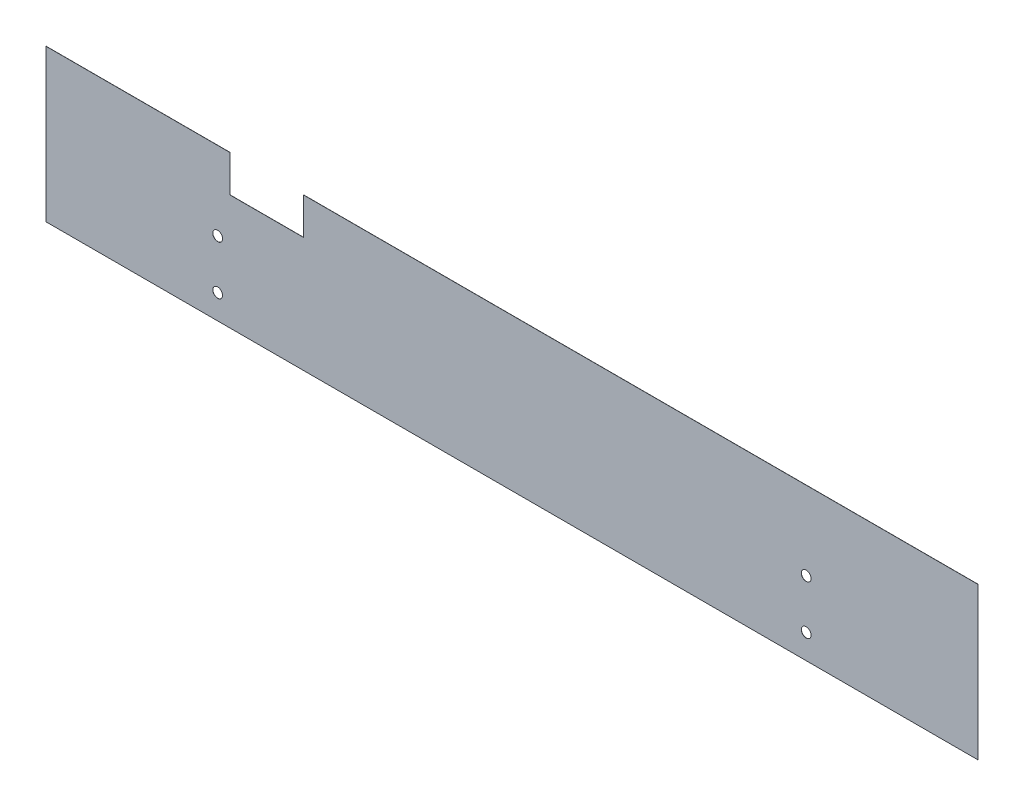
ISO-10303-21;
HEADER;
FILE_DESCRIPTION(('STEP AP214'),'2;1');
FILE_NAME('part.step','',(''),(''),'','','');
FILE_SCHEMA(('AUTOMOTIVE_DESIGN { 1 0 10303 214 1 1 1 1 }'));
ENDSEC;
DATA;
#1=APPLICATION_CONTEXT('core data for automotive mechanical design processes');
#2=APPLICATION_PROTOCOL_DEFINITION('international standard','automotive_design',2000,#1);
#3=PRODUCT_CONTEXT('',#1,'mechanical');
#4=PRODUCT('Part','Part','',(#3));
#5=PRODUCT_RELATED_PRODUCT_CATEGORY('part','',(#4));
#6=PRODUCT_DEFINITION_FORMATION('','',#4);
#7=PRODUCT_DEFINITION_CONTEXT('part definition',#1,'design');
#8=PRODUCT_DEFINITION('design','',#6,#7);
#9=PRODUCT_DEFINITION_SHAPE('','',#8);
#10=(LENGTH_UNIT() NAMED_UNIT(*) SI_UNIT(.MILLI.,.METRE.));
#11=(NAMED_UNIT(*) PLANE_ANGLE_UNIT() SI_UNIT($,.RADIAN.));
#12=(NAMED_UNIT(*) SI_UNIT($,.STERADIAN.) SOLID_ANGLE_UNIT());
#13=UNCERTAINTY_MEASURE_WITH_UNIT(LENGTH_MEASURE(1.E-05),#10,'distance_accuracy_value','');
#14=(GEOMETRIC_REPRESENTATION_CONTEXT(3) GLOBAL_UNCERTAINTY_ASSIGNED_CONTEXT((#13)) GLOBAL_UNIT_ASSIGNED_CONTEXT((#10,
#11,#12)) REPRESENTATION_CONTEXT('',''));
#15=CARTESIAN_POINT('',(0.,0.,0.));
#16=DIRECTION('',(0.,0.,1.));
#17=DIRECTION('',(1.,0.,0.));
#18=AXIS2_PLACEMENT_3D('',#15,#16,#17);
#19=CARTESIAN_POINT('',(-190.,31.,0.0625));
#20=DIRECTION('',(0.,-1.,0.));
#21=DIRECTION('',(0.,0.,-1.));
#22=AXIS2_PLACEMENT_3D('',#19,#20,#21);
#23=PLANE('',#22);
#24=DIRECTION('',(-1.,0.,0.));
#25=VECTOR('',#24,1.);
#26=CARTESIAN_POINT('',(-190.,31.,0.0625));
#27=LINE('',#26,#25);
#28=CARTESIAN_POINT('',(-115.,31.,0.0625));
#29=VERTEX_POINT('',#28);
#30=CARTESIAN_POINT('',(-190.,31.,0.0625));
#31=VERTEX_POINT('',#30);
#32=EDGE_CURVE('E169',#29,#31,#27,.T.);
#33=ORIENTED_EDGE('',*,*,#32,.F.);
#34=DIRECTION('',(0.,0.,1.));
#35=VECTOR('',#34,1.);
#36=CARTESIAN_POINT('',(-115.,31.,0.));
#37=LINE('',#36,#35);
#38=CARTESIAN_POINT('',(-115.,31.,0.));
#39=VERTEX_POINT('',#38);
#40=EDGE_CURVE('E137',#39,#29,#37,.T.);
#41=ORIENTED_EDGE('',*,*,#40,.F.);
#42=DIRECTION('',(-1.,0.,0.));
#43=VECTOR('',#42,1.);
#44=CARTESIAN_POINT('',(-190.,31.,0.));
#45=LINE('',#44,#43);
#46=CARTESIAN_POINT('',(-190.,31.,0.));
#47=VERTEX_POINT('',#46);
#48=EDGE_CURVE('E128',#39,#47,#45,.T.);
#49=ORIENTED_EDGE('',*,*,#48,.T.);
#50=DIRECTION('',(0.,0.,-1.));
#51=VECTOR('',#50,1.);
#52=CARTESIAN_POINT('',(-190.,31.,0.0625));
#53=LINE('',#52,#51);
#54=EDGE_CURVE('E40',#31,#47,#53,.T.);
#55=ORIENTED_EDGE('',*,*,#54,.F.);
#56=EDGE_LOOP('',(#33,#41,#49,#55));
#57=FACE_BOUND('',#56,.T.);
#58=ADVANCED_FACE('F32',(#57),#23,.F.);
#59=CARTESIAN_POINT('',(190.,-31.,0.0625));
#60=DIRECTION('',(-1.,0.,0.));
#61=DIRECTION('',(0.,0.,1.));
#62=AXIS2_PLACEMENT_3D('',#59,#60,#61);
#63=PLANE('',#62);
#64=DIRECTION('',(0.,1.,0.));
#65=VECTOR('',#64,1.);
#66=CARTESIAN_POINT('',(190.,-31.,0.));
#67=LINE('',#66,#65);
#68=CARTESIAN_POINT('',(190.,-31.,0.));
#69=VERTEX_POINT('',#68);
#70=CARTESIAN_POINT('',(190.,31.,0.));
#71=VERTEX_POINT('',#70);
#72=EDGE_CURVE('E164',#69,#71,#67,.T.);
#73=ORIENTED_EDGE('',*,*,#72,.T.);
#74=DIRECTION('',(0.,0.,-1.));
#75=VECTOR('',#74,1.);
#76=CARTESIAN_POINT('',(190.,31.,0.0625));
#77=LINE('',#76,#75);
#78=CARTESIAN_POINT('',(190.,31.,0.0625));
#79=VERTEX_POINT('',#78);
#80=EDGE_CURVE('E11',#79,#71,#77,.T.);
#81=ORIENTED_EDGE('',*,*,#80,.F.);
#82=DIRECTION('',(0.,1.,0.));
#83=VECTOR('',#82,1.);
#84=CARTESIAN_POINT('',(190.,-31.,0.0625));
#85=LINE('',#84,#83);
#86=CARTESIAN_POINT('',(190.,-31.,0.0625));
#87=VERTEX_POINT('',#86);
#88=EDGE_CURVE('E167',#87,#79,#85,.T.);
#89=ORIENTED_EDGE('',*,*,#88,.F.);
#90=DIRECTION('',(0.,0.,-1.));
#91=VECTOR('',#90,1.);
#92=CARTESIAN_POINT('',(190.,-31.,0.0625));
#93=LINE('',#92,#91);
#94=EDGE_CURVE('E174',#87,#69,#93,.T.);
#95=ORIENTED_EDGE('',*,*,#94,.T.);
#96=EDGE_LOOP('',(#73,#81,#89,#95));
#97=FACE_BOUND('',#96,.T.);
#98=ADVANCED_FACE('F34',(#97),#63,.F.);
#99=CARTESIAN_POINT('',(-85.,31.,0.));
#100=VERTEX_POINT('',#99);
#101=EDGE_CURVE('E177',#71,#100,#45,.T.);
#102=ORIENTED_EDGE('',*,*,#101,.T.);
#103=DIRECTION('',(0.,0.,1.));
#104=VECTOR('',#103,1.);
#105=CARTESIAN_POINT('',(-85.,31.,0.));
#106=LINE('',#105,#104);
#107=CARTESIAN_POINT('',(-85.,31.,0.0625));
#108=VERTEX_POINT('',#107);
#109=EDGE_CURVE('E140',#100,#108,#106,.T.);
#110=ORIENTED_EDGE('',*,*,#109,.T.);
#111=EDGE_CURVE('E84',#79,#108,#27,.T.);
#112=ORIENTED_EDGE('',*,*,#111,.F.);
#113=ORIENTED_EDGE('',*,*,#80,.T.);
#114=EDGE_LOOP('',(#102,#110,#112,#113));
#115=FACE_BOUND('',#114,.T.);
#116=ADVANCED_FACE('F208',(#115),#23,.F.);
#117=CARTESIAN_POINT('',(-190.,-31.,0.0625));
#118=DIRECTION('',(1.,0.,0.));
#119=DIRECTION('',(0.,0.,-1.));
#120=AXIS2_PLACEMENT_3D('',#117,#118,#119);
#121=PLANE('',#120);
#122=DIRECTION('',(0.,-1.,0.));
#123=VECTOR('',#122,1.);
#124=CARTESIAN_POINT('',(-190.,-31.,0.));
#125=LINE('',#124,#123);
#126=CARTESIAN_POINT('',(-190.,-31.,0.));
#127=VERTEX_POINT('',#126);
#128=EDGE_CURVE('E180',#47,#127,#125,.T.);
#129=ORIENTED_EDGE('',*,*,#128,.T.);
#130=DIRECTION('',(0.,0.,-1.));
#131=VECTOR('',#130,1.);
#132=CARTESIAN_POINT('',(-190.,-31.,0.0625));
#133=LINE('',#132,#131);
#134=CARTESIAN_POINT('',(-190.,-31.,0.0625));
#135=VERTEX_POINT('',#134);
#136=EDGE_CURVE('E184',#135,#127,#133,.T.);
#137=ORIENTED_EDGE('',*,*,#136,.F.);
#138=DIRECTION('',(0.,-1.,0.));
#139=VECTOR('',#138,1.);
#140=CARTESIAN_POINT('',(-190.,-31.,0.0625));
#141=LINE('',#140,#139);
#142=EDGE_CURVE('E171',#31,#135,#141,.T.);
#143=ORIENTED_EDGE('',*,*,#142,.F.);
#144=ORIENTED_EDGE('',*,*,#54,.T.);
#145=EDGE_LOOP('',(#129,#137,#143,#144));
#146=FACE_BOUND('',#145,.T.);
#147=ADVANCED_FACE('F189',(#146),#121,.F.);
#148=CARTESIAN_POINT('',(-190.,-31.,0.0625));
#149=DIRECTION('',(0.,1.,0.));
#150=DIRECTION('',(0.,0.,1.));
#151=AXIS2_PLACEMENT_3D('',#148,#149,#150);
#152=PLANE('',#151);
#153=DIRECTION('',(1.,0.,0.));
#154=VECTOR('',#153,1.);
#155=CARTESIAN_POINT('',(-190.,-31.,0.));
#156=LINE('',#155,#154);
#157=EDGE_CURVE('E77',#127,#69,#156,.T.);
#158=ORIENTED_EDGE('',*,*,#157,.T.);
#159=ORIENTED_EDGE('',*,*,#94,.F.);
#160=DIRECTION('',(1.,0.,0.));
#161=VECTOR('',#160,1.);
#162=CARTESIAN_POINT('',(-190.,-31.,0.0625));
#163=LINE('',#162,#161);
#164=EDGE_CURVE('E56',#135,#87,#163,.T.);
#165=ORIENTED_EDGE('',*,*,#164,.F.);
#166=ORIENTED_EDGE('',*,*,#136,.T.);
#167=EDGE_LOOP('',(#158,#159,#165,#166));
#168=FACE_BOUND('',#167,.T.);
#169=ADVANCED_FACE('F197',(#168),#152,.F.);
#170=CARTESIAN_POINT('',(0.,0.,0.0625));
#171=DIRECTION('',(0.,0.,-1.));
#172=DIRECTION('',(-1.,0.,0.));
#173=AXIS2_PLACEMENT_3D('',#170,#171,#172);
#174=PLANE('',#173);
#175=CARTESIAN_POINT('',(-120.,-21.,0.0625));
#176=DIRECTION('',(0.,0.,1.));
#177=DIRECTION('',(1.,0.,0.));
#178=AXIS2_PLACEMENT_3D('',#175,#176,#177);
#179=CIRCLE('',#178,2.);
#180=CARTESIAN_POINT('',(-118.,-21.,0.0625));
#181=VERTEX_POINT('',#180);
#182=EDGE_CURVE('E139',#181,#181,#179,.T.);
#183=ORIENTED_EDGE('',*,*,#182,.F.);
#184=EDGE_LOOP('',(#183));
#185=FACE_BOUND('',#184,.T.);
#186=CARTESIAN_POINT('',(120.,-21.,0.0625));
#187=DIRECTION('',(0.,0.,1.));
#188=DIRECTION('',(1.,0.,0.));
#189=AXIS2_PLACEMENT_3D('',#186,#187,#188);
#190=CIRCLE('',#189,2.);
#191=CARTESIAN_POINT('',(122.,-21.,0.0625));
#192=VERTEX_POINT('',#191);
#193=EDGE_CURVE('E153',#192,#192,#190,.T.);
#194=ORIENTED_EDGE('',*,*,#193,.F.);
#195=EDGE_LOOP('',(#194));
#196=FACE_BOUND('',#195,.T.);
#197=CARTESIAN_POINT('',(120.,-0.999999999999968,0.0625));
#198=DIRECTION('',(0.,0.,1.));
#199=DIRECTION('',(1.,0.,0.));
#200=AXIS2_PLACEMENT_3D('',#197,#198,#199);
#201=CIRCLE('',#200,2.);
#202=CARTESIAN_POINT('',(122.,-0.999999999999968,0.0625));
#203=VERTEX_POINT('',#202);
#204=EDGE_CURVE('E147',#203,#203,#201,.T.);
#205=ORIENTED_EDGE('',*,*,#204,.F.);
#206=EDGE_LOOP('',(#205));
#207=FACE_BOUND('',#206,.T.);
#208=CARTESIAN_POINT('',(-120.,-0.999999999999997,0.0625));
#209=DIRECTION('',(0.,0.,1.));
#210=DIRECTION('',(1.,0.,0.));
#211=AXIS2_PLACEMENT_3D('',#208,#209,#210);
#212=CIRCLE('',#211,2.);
#213=CARTESIAN_POINT('',(-118.,-0.999999999999997,0.0625));
#214=VERTEX_POINT('',#213);
#215=EDGE_CURVE('E146',#214,#214,#212,.T.);
#216=ORIENTED_EDGE('',*,*,#215,.F.);
#217=EDGE_LOOP('',(#216));
#218=FACE_BOUND('',#217,.T.);
#219=DIRECTION('',(1.,0.,0.));
#220=VECTOR('',#219,1.);
#221=CARTESIAN_POINT('',(-115.,16.,0.0625));
#222=LINE('',#221,#220);
#223=CARTESIAN_POINT('',(-115.,16.,0.0625));
#224=VERTEX_POINT('',#223);
#225=CARTESIAN_POINT('',(-85.,16.,0.0625));
#226=VERTEX_POINT('',#225);
#227=EDGE_CURVE('E131',#224,#226,#222,.T.);
#228=ORIENTED_EDGE('',*,*,#227,.F.);
#229=DIRECTION('',(0.,-1.,0.));
#230=VECTOR('',#229,1.);
#231=CARTESIAN_POINT('',(-115.,31.,0.0625));
#232=LINE('',#231,#230);
#233=EDGE_CURVE('E113',#29,#224,#232,.T.);
#234=ORIENTED_EDGE('',*,*,#233,.F.);
#235=ORIENTED_EDGE('',*,*,#32,.T.);
#236=ORIENTED_EDGE('',*,*,#142,.T.);
#237=ORIENTED_EDGE('',*,*,#164,.T.);
#238=ORIENTED_EDGE('',*,*,#88,.T.);
#239=ORIENTED_EDGE('',*,*,#111,.T.);
#240=DIRECTION('',(0.,1.,0.));
#241=VECTOR('',#240,1.);
#242=CARTESIAN_POINT('',(-85.,31.,0.0625));
#243=LINE('',#242,#241);
#244=EDGE_CURVE('E129',#226,#108,#243,.T.);
#245=ORIENTED_EDGE('',*,*,#244,.F.);
#246=EDGE_LOOP('',(#228,#234,#235,#236,#237,#238,#239,#245));
#247=FACE_BOUND('',#246,.T.);
#248=ADVANCED_FACE('F199',(#185,#196,#207,#218,#247),#174,.F.);
#249=CARTESIAN_POINT('',(0.,0.,0.));
#250=DIRECTION('',(0.,0.,-1.));
#251=DIRECTION('',(-1.,0.,0.));
#252=AXIS2_PLACEMENT_3D('',#249,#250,#251);
#253=PLANE('',#252);
#254=DIRECTION('',(0.,-1.,0.));
#255=VECTOR('',#254,1.);
#256=CARTESIAN_POINT('',(-115.,31.,0.));
#257=LINE('',#256,#255);
#258=CARTESIAN_POINT('',(-115.,16.,0.));
#259=VERTEX_POINT('',#258);
#260=EDGE_CURVE('E110',#39,#259,#257,.T.);
#261=ORIENTED_EDGE('',*,*,#260,.T.);
#262=DIRECTION('',(1.,0.,0.));
#263=VECTOR('',#262,1.);
#264=CARTESIAN_POINT('',(-115.,16.,0.));
#265=LINE('',#264,#263);
#266=CARTESIAN_POINT('',(-85.,16.,0.));
#267=VERTEX_POINT('',#266);
#268=EDGE_CURVE('E120',#259,#267,#265,.T.);
#269=ORIENTED_EDGE('',*,*,#268,.T.);
#270=DIRECTION('',(0.,1.,0.));
#271=VECTOR('',#270,1.);
#272=CARTESIAN_POINT('',(-85.,31.,0.));
#273=LINE('',#272,#271);
#274=EDGE_CURVE('E47',#267,#100,#273,.T.);
#275=ORIENTED_EDGE('',*,*,#274,.T.);
#276=ORIENTED_EDGE('',*,*,#101,.F.);
#277=ORIENTED_EDGE('',*,*,#72,.F.);
#278=ORIENTED_EDGE('',*,*,#157,.F.);
#279=ORIENTED_EDGE('',*,*,#128,.F.);
#280=ORIENTED_EDGE('',*,*,#48,.F.);
#281=EDGE_LOOP('',(#261,#269,#275,#276,#277,#278,#279,#280));
#282=FACE_BOUND('',#281,.T.);
#283=CARTESIAN_POINT('',(-120.,-21.,0.));
#284=DIRECTION('',(0.,0.,1.));
#285=DIRECTION('',(1.,0.,0.));
#286=AXIS2_PLACEMENT_3D('',#283,#284,#285);
#287=CIRCLE('',#286,2.);
#288=CARTESIAN_POINT('',(-118.,-21.,0.));
#289=VERTEX_POINT('',#288);
#290=EDGE_CURVE('E156',#289,#289,#287,.T.);
#291=ORIENTED_EDGE('',*,*,#290,.T.);
#292=EDGE_LOOP('',(#291));
#293=FACE_BOUND('',#292,.T.);
#294=CARTESIAN_POINT('',(120.,-21.,0.));
#295=DIRECTION('',(0.,0.,1.));
#296=DIRECTION('',(1.,0.,0.));
#297=AXIS2_PLACEMENT_3D('',#294,#295,#296);
#298=CIRCLE('',#297,2.);
#299=CARTESIAN_POINT('',(122.,-21.,0.));
#300=VERTEX_POINT('',#299);
#301=EDGE_CURVE('E150',#300,#300,#298,.T.);
#302=ORIENTED_EDGE('',*,*,#301,.T.);
#303=EDGE_LOOP('',(#302));
#304=FACE_BOUND('',#303,.T.);
#305=CARTESIAN_POINT('',(120.,-0.999999999999968,0.));
#306=DIRECTION('',(0.,0.,1.));
#307=DIRECTION('',(1.,0.,0.));
#308=AXIS2_PLACEMENT_3D('',#305,#306,#307);
#309=CIRCLE('',#308,2.);
#310=CARTESIAN_POINT('',(122.,-0.999999999999968,0.));
#311=VERTEX_POINT('',#310);
#312=EDGE_CURVE('E143',#311,#311,#309,.T.);
#313=ORIENTED_EDGE('',*,*,#312,.T.);
#314=EDGE_LOOP('',(#313));
#315=FACE_BOUND('',#314,.T.);
#316=CARTESIAN_POINT('',(-120.,-0.999999999999997,0.));
#317=DIRECTION('',(0.,0.,1.));
#318=DIRECTION('',(1.,0.,0.));
#319=AXIS2_PLACEMENT_3D('',#316,#317,#318);
#320=CIRCLE('',#319,2.);
#321=CARTESIAN_POINT('',(-118.,-0.999999999999997,0.));
#322=VERTEX_POINT('',#321);
#323=EDGE_CURVE('E161',#322,#322,#320,.T.);
#324=ORIENTED_EDGE('',*,*,#323,.T.);
#325=EDGE_LOOP('',(#324));
#326=FACE_BOUND('',#325,.T.);
#327=ADVANCED_FACE('F125',(#282,#293,#304,#315,#326),#253,.T.);
#328=CARTESIAN_POINT('',(-120.,-0.999999999999997,0.));
#329=DIRECTION('',(0.,0.,1.));
#330=DIRECTION('',(1.,0.,0.));
#331=AXIS2_PLACEMENT_3D('',#328,#329,#330);
#332=CYLINDRICAL_SURFACE('',#331,2.);
#333=ORIENTED_EDGE('',*,*,#323,.F.);
#334=EDGE_LOOP('',(#333));
#335=FACE_BOUND('',#334,.T.);
#336=ORIENTED_EDGE('',*,*,#215,.T.);
#337=EDGE_LOOP('',(#336));
#338=FACE_BOUND('',#337,.T.);
#339=ADVANCED_FACE('F235',(#335,#338),#332,.F.);
#340=CARTESIAN_POINT('',(120.,-0.999999999999968,0.));
#341=DIRECTION('',(0.,0.,1.));
#342=DIRECTION('',(1.,0.,0.));
#343=AXIS2_PLACEMENT_3D('',#340,#341,#342);
#344=CYLINDRICAL_SURFACE('',#343,2.);
#345=ORIENTED_EDGE('',*,*,#312,.F.);
#346=EDGE_LOOP('',(#345));
#347=FACE_BOUND('',#346,.T.);
#348=ORIENTED_EDGE('',*,*,#204,.T.);
#349=EDGE_LOOP('',(#348));
#350=FACE_BOUND('',#349,.T.);
#351=ADVANCED_FACE('F231',(#347,#350),#344,.F.);
#352=CARTESIAN_POINT('',(120.,-21.,0.));
#353=DIRECTION('',(0.,0.,1.));
#354=DIRECTION('',(1.,0.,0.));
#355=AXIS2_PLACEMENT_3D('',#352,#353,#354);
#356=CYLINDRICAL_SURFACE('',#355,2.);
#357=ORIENTED_EDGE('',*,*,#301,.F.);
#358=EDGE_LOOP('',(#357));
#359=FACE_BOUND('',#358,.T.);
#360=ORIENTED_EDGE('',*,*,#193,.T.);
#361=EDGE_LOOP('',(#360));
#362=FACE_BOUND('',#361,.T.);
#363=ADVANCED_FACE('F234',(#359,#362),#356,.F.);
#364=CARTESIAN_POINT('',(-120.,-21.,0.));
#365=DIRECTION('',(0.,0.,1.));
#366=DIRECTION('',(1.,0.,0.));
#367=AXIS2_PLACEMENT_3D('',#364,#365,#366);
#368=CYLINDRICAL_SURFACE('',#367,2.);
#369=ORIENTED_EDGE('',*,*,#290,.F.);
#370=EDGE_LOOP('',(#369));
#371=FACE_BOUND('',#370,.T.);
#372=ORIENTED_EDGE('',*,*,#182,.T.);
#373=EDGE_LOOP('',(#372));
#374=FACE_BOUND('',#373,.T.);
#375=ADVANCED_FACE('F228',(#371,#374),#368,.F.);
#376=CARTESIAN_POINT('',(-115.,31.,0.));
#377=DIRECTION('',(-1.,0.,0.));
#378=DIRECTION('',(0.,-1.,0.));
#379=AXIS2_PLACEMENT_3D('',#376,#377,#378);
#380=PLANE('',#379);
#381=ORIENTED_EDGE('',*,*,#233,.T.);
#382=DIRECTION('',(0.,0.,1.));
#383=VECTOR('',#382,1.);
#384=CARTESIAN_POINT('',(-115.,16.,0.));
#385=LINE('',#384,#383);
#386=EDGE_CURVE('E106',#259,#224,#385,.T.);
#387=ORIENTED_EDGE('',*,*,#386,.F.);
#388=ORIENTED_EDGE('',*,*,#260,.F.);
#389=ORIENTED_EDGE('',*,*,#40,.T.);
#390=EDGE_LOOP('',(#381,#387,#388,#389));
#391=FACE_BOUND('',#390,.T.);
#392=ADVANCED_FACE('F108',(#391),#380,.F.);
#393=CARTESIAN_POINT('',(-85.,31.,0.));
#394=DIRECTION('',(1.,0.,0.));
#395=DIRECTION('',(0.,0.,-1.));
#396=AXIS2_PLACEMENT_3D('',#393,#394,#395);
#397=PLANE('',#396);
#398=ORIENTED_EDGE('',*,*,#244,.T.);
#399=ORIENTED_EDGE('',*,*,#109,.F.);
#400=ORIENTED_EDGE('',*,*,#274,.F.);
#401=DIRECTION('',(0.,0.,1.));
#402=VECTOR('',#401,1.);
#403=CARTESIAN_POINT('',(-85.,16.,0.));
#404=LINE('',#403,#402);
#405=EDGE_CURVE('E117',#267,#226,#404,.T.);
#406=ORIENTED_EDGE('',*,*,#405,.T.);
#407=EDGE_LOOP('',(#398,#399,#400,#406));
#408=FACE_BOUND('',#407,.T.);
#409=ADVANCED_FACE('F220',(#408),#397,.F.);
#410=CARTESIAN_POINT('',(-115.,16.,0.));
#411=DIRECTION('',(0.,-1.,0.));
#412=DIRECTION('',(0.,0.,-1.));
#413=AXIS2_PLACEMENT_3D('',#410,#411,#412);
#414=PLANE('',#413);
#415=ORIENTED_EDGE('',*,*,#227,.T.);
#416=ORIENTED_EDGE('',*,*,#405,.F.);
#417=ORIENTED_EDGE('',*,*,#268,.F.);
#418=ORIENTED_EDGE('',*,*,#386,.T.);
#419=EDGE_LOOP('',(#415,#416,#417,#418));
#420=FACE_BOUND('',#419,.T.);
#421=ADVANCED_FACE('F121',(#420),#414,.F.);
#422=CLOSED_SHELL('',(#58,#98,#116,#147,#169,#248,#327,#339,#351,#363,#375,#392,#409,#421));
#423=MANIFOLD_SOLID_BREP('B2',#422);
#424=ADVANCED_BREP_SHAPE_REPRESENTATION('',(#18,#423),#14);
#425=SHAPE_DEFINITION_REPRESENTATION(#9,#424);
ENDSEC;
END-ISO-10303-21;
